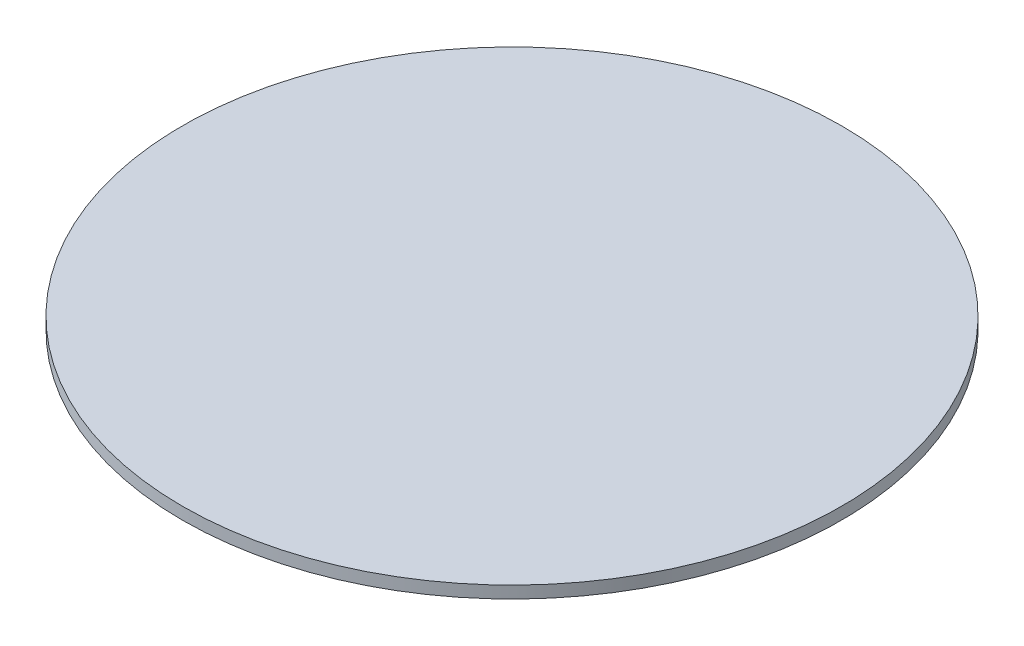
ISO-10303-21;
HEADER;
FILE_DESCRIPTION(('STEP AP214'),'2;1');
FILE_NAME('part.step','',(''),(''),'','','');
FILE_SCHEMA(('AUTOMOTIVE_DESIGN { 1 0 10303 214 1 1 1 1 }'));
ENDSEC;
DATA;
#1=APPLICATION_CONTEXT('core data for automotive mechanical design processes');
#2=APPLICATION_PROTOCOL_DEFINITION('international standard','automotive_design',2000,#1);
#3=PRODUCT_CONTEXT('',#1,'mechanical');
#4=PRODUCT('Part','Part','',(#3));
#5=PRODUCT_RELATED_PRODUCT_CATEGORY('part','',(#4));
#6=PRODUCT_DEFINITION_FORMATION('','',#4);
#7=PRODUCT_DEFINITION_CONTEXT('part definition',#1,'design');
#8=PRODUCT_DEFINITION('design','',#6,#7);
#9=PRODUCT_DEFINITION_SHAPE('','',#8);
#10=(LENGTH_UNIT() NAMED_UNIT(*) SI_UNIT(.MILLI.,.METRE.));
#11=(NAMED_UNIT(*) PLANE_ANGLE_UNIT() SI_UNIT($,.RADIAN.));
#12=(NAMED_UNIT(*) SI_UNIT($,.STERADIAN.) SOLID_ANGLE_UNIT());
#13=UNCERTAINTY_MEASURE_WITH_UNIT(LENGTH_MEASURE(1.E-05),#10,'distance_accuracy_value','');
#14=(GEOMETRIC_REPRESENTATION_CONTEXT(3) GLOBAL_UNCERTAINTY_ASSIGNED_CONTEXT((#13)) GLOBAL_UNIT_ASSIGNED_CONTEXT((#10,
#11,#12)) REPRESENTATION_CONTEXT('',''));
#15=CARTESIAN_POINT('',(0.,0.,0.));
#16=DIRECTION('',(0.,0.,1.));
#17=DIRECTION('',(1.,0.,0.));
#18=AXIS2_PLACEMENT_3D('',#15,#16,#17);
#19=CARTESIAN_POINT('',(0.,76.2,0.));
#20=DIRECTION('',(0.,-1.,0.));
#21=DIRECTION('',(0.,0.,-1.));
#22=AXIS2_PLACEMENT_3D('',#19,#20,#21);
#23=CYLINDRICAL_SURFACE('',#22,2076.2);
#24=CARTESIAN_POINT('',(0.,76.2,0.));
#25=DIRECTION('',(0.,1.,0.));
#26=DIRECTION('',(0.,0.,1.));
#27=AXIS2_PLACEMENT_3D('',#24,#25,#26);
#28=CIRCLE('',#27,2076.2);
#29=CARTESIAN_POINT('',(0.,76.2,2076.2));
#30=VERTEX_POINT('',#29);
#31=EDGE_CURVE('E10',#30,#30,#28,.T.);
#32=ORIENTED_EDGE('',*,*,#31,.F.);
#33=EDGE_LOOP('',(#32));
#34=FACE_BOUND('',#33,.T.);
#35=CARTESIAN_POINT('',(0.,0.,0.));
#36=DIRECTION('',(0.,1.,0.));
#37=DIRECTION('',(0.,0.,1.));
#38=AXIS2_PLACEMENT_3D('',#35,#36,#37);
#39=CIRCLE('',#38,2076.2);
#40=CARTESIAN_POINT('',(0.,0.,2076.2));
#41=VERTEX_POINT('',#40);
#42=EDGE_CURVE('E38',#41,#41,#39,.T.);
#43=ORIENTED_EDGE('',*,*,#42,.T.);
#44=EDGE_LOOP('',(#43));
#45=FACE_BOUND('',#44,.T.);
#46=ADVANCED_FACE('F35',(#34,#45),#23,.T.);
#47=CARTESIAN_POINT('',(0.,76.2,0.));
#48=DIRECTION('',(0.,1.,0.));
#49=DIRECTION('',(0.,0.,1.));
#50=AXIS2_PLACEMENT_3D('',#47,#48,#49);
#51=PLANE('',#50);
#52=ORIENTED_EDGE('',*,*,#31,.T.);
#53=EDGE_LOOP('',(#52));
#54=FACE_BOUND('',#53,.T.);
#55=ADVANCED_FACE('F50',(#54),#51,.T.);
#56=CARTESIAN_POINT('',(0.,0.,0.));
#57=DIRECTION('',(0.,1.,0.));
#58=DIRECTION('',(0.,0.,1.));
#59=AXIS2_PLACEMENT_3D('',#56,#57,#58);
#60=PLANE('',#59);
#61=ORIENTED_EDGE('',*,*,#42,.F.);
#62=EDGE_LOOP('',(#61));
#63=FACE_BOUND('',#62,.T.);
#64=ADVANCED_FACE('F48',(#63),#60,.F.);
#65=CLOSED_SHELL('',(#46,#55,#64));
#66=MANIFOLD_SOLID_BREP('B2',#65);
#67=ADVANCED_BREP_SHAPE_REPRESENTATION('',(#18,#66),#14);
#68=SHAPE_DEFINITION_REPRESENTATION(#9,#67);
ENDSEC;
END-ISO-10303-21;
